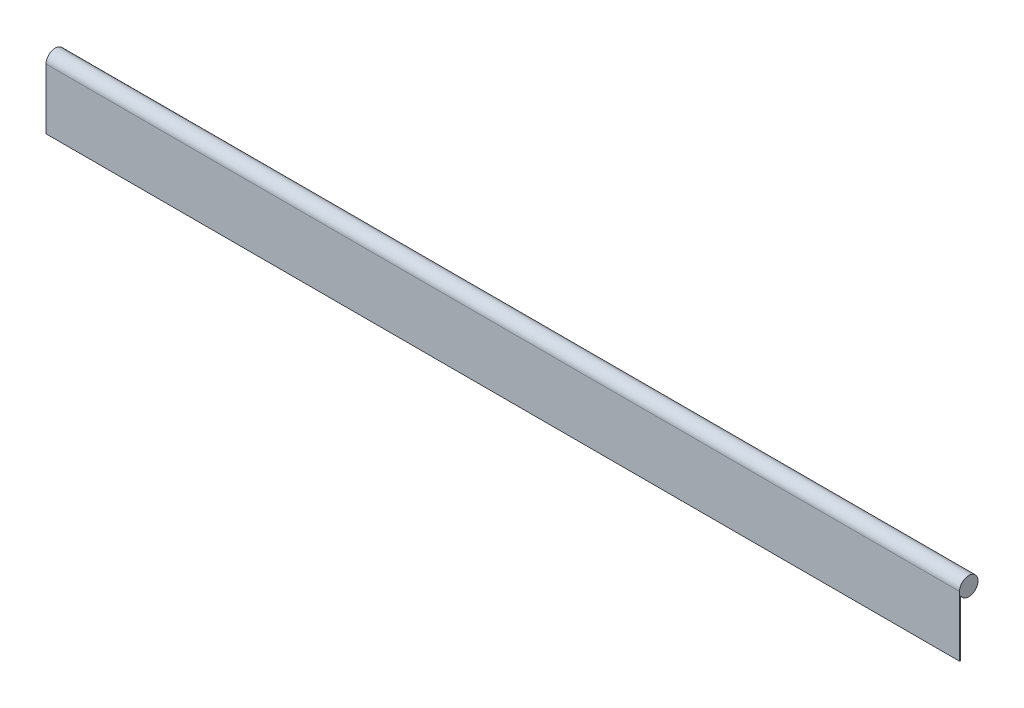
ISO-10303-21;
HEADER;
FILE_DESCRIPTION(('STEP AP214'),'2;1');
FILE_NAME('part.step','',(''),(''),'','','');
FILE_SCHEMA(('AUTOMOTIVE_DESIGN { 1 0 10303 214 1 1 1 1 }'));
ENDSEC;
DATA;
#1=APPLICATION_CONTEXT('core data for automotive mechanical design processes');
#2=APPLICATION_PROTOCOL_DEFINITION('international standard','automotive_design',2000,#1);
#3=PRODUCT_CONTEXT('',#1,'mechanical');
#4=PRODUCT('Part','Part','',(#3));
#5=PRODUCT_RELATED_PRODUCT_CATEGORY('part','',(#4));
#6=PRODUCT_DEFINITION_FORMATION('','',#4);
#7=PRODUCT_DEFINITION_CONTEXT('part definition',#1,'design');
#8=PRODUCT_DEFINITION('design','',#6,#7);
#9=PRODUCT_DEFINITION_SHAPE('','',#8);
#10=(LENGTH_UNIT() NAMED_UNIT(*) SI_UNIT(.MILLI.,.METRE.));
#11=(NAMED_UNIT(*) PLANE_ANGLE_UNIT() SI_UNIT($,.RADIAN.));
#12=(NAMED_UNIT(*) SI_UNIT($,.STERADIAN.) SOLID_ANGLE_UNIT());
#13=UNCERTAINTY_MEASURE_WITH_UNIT(LENGTH_MEASURE(1.E-05),#10,'distance_accuracy_value','');
#14=(GEOMETRIC_REPRESENTATION_CONTEXT(3) GLOBAL_UNCERTAINTY_ASSIGNED_CONTEXT((#13)) GLOBAL_UNIT_ASSIGNED_CONTEXT((#10,
#11,#12)) REPRESENTATION_CONTEXT('',''));
#15=CARTESIAN_POINT('',(0.,0.,0.));
#16=DIRECTION('',(0.,0.,1.));
#17=DIRECTION('',(1.,0.,0.));
#18=AXIS2_PLACEMENT_3D('',#15,#16,#17);
#19=CARTESIAN_POINT('',(1727.2,0.,0.));
#20=DIRECTION('',(-1.,0.,0.));
#21=DIRECTION('',(0.,0.,1.));
#22=AXIS2_PLACEMENT_3D('',#19,#20,#21);
#23=CYLINDRICAL_SURFACE('',#22,17.4625);
#24=CARTESIAN_POINT('',(0.,0.,0.));
#25=DIRECTION('',(1.,0.,0.));
#26=DIRECTION('',(0.,0.,-1.));
#27=AXIS2_PLACEMENT_3D('',#24,#25,#26);
#28=CIRCLE('',#27,17.4625);
#29=CARTESIAN_POINT('',(0.,-7.27483891574244,15.875));
#30=VERTEX_POINT('',#29);
#31=CARTESIAN_POINT('',(0.,0.,17.4625));
#32=VERTEX_POINT('',#31);
#33=EDGE_CURVE('E96',#30,#32,#28,.T.);
#34=ORIENTED_EDGE('',*,*,#33,.T.);
#35=DIRECTION('',(-1.,0.,0.));
#36=VECTOR('',#35,1.);
#37=CARTESIAN_POINT('',(1727.2,0.,17.4625));
#38=LINE('',#37,#36);
#39=CARTESIAN_POINT('',(1727.2,0.,17.4625));
#40=VERTEX_POINT('',#39);
#41=EDGE_CURVE('E11',#40,#32,#38,.T.);
#42=ORIENTED_EDGE('',*,*,#41,.F.);
#43=CARTESIAN_POINT('',(1727.2,0.,0.));
#44=DIRECTION('',(1.,0.,0.));
#45=DIRECTION('',(0.,0.,-1.));
#46=AXIS2_PLACEMENT_3D('',#43,#44,#45);
#47=CIRCLE('',#46,17.4625);
#48=CARTESIAN_POINT('',(1727.2,-7.27483891574244,15.875));
#49=VERTEX_POINT('',#48);
#50=EDGE_CURVE('E84',#49,#40,#47,.T.);
#51=ORIENTED_EDGE('',*,*,#50,.F.);
#52=DIRECTION('',(-1.,0.,0.));
#53=VECTOR('',#52,1.);
#54=CARTESIAN_POINT('',(1727.2,-7.27483891574244,15.875));
#55=LINE('',#54,#53);
#56=EDGE_CURVE('E92',#49,#30,#55,.T.);
#57=ORIENTED_EDGE('',*,*,#56,.T.);
#58=EDGE_LOOP('',(#34,#42,#51,#57));
#59=FACE_BOUND('',#58,.T.);
#60=ADVANCED_FACE('F33',(#59),#23,.T.);
#61=CARTESIAN_POINT('',(1727.2,0.,17.4625));
#62=DIRECTION('',(0.,0.,-1.));
#63=DIRECTION('',(0.,1.,0.));
#64=AXIS2_PLACEMENT_3D('',#61,#62,#63);
#65=PLANE('',#64);
#66=DIRECTION('',(0.,-1.,0.));
#67=VECTOR('',#66,1.);
#68=CARTESIAN_POINT('',(0.,0.,17.4625));
#69=LINE('',#68,#67);
#70=CARTESIAN_POINT('',(0.,-114.3,17.4625));
#71=VERTEX_POINT('',#70);
#72=EDGE_CURVE('E88',#32,#71,#69,.T.);
#73=ORIENTED_EDGE('',*,*,#72,.T.);
#74=DIRECTION('',(-1.,0.,0.));
#75=VECTOR('',#74,1.);
#76=CARTESIAN_POINT('',(1727.2,-114.3,17.4625));
#77=LINE('',#76,#75);
#78=CARTESIAN_POINT('',(1727.2,-114.3,17.4625));
#79=VERTEX_POINT('',#78);
#80=EDGE_CURVE('E41',#79,#71,#77,.T.);
#81=ORIENTED_EDGE('',*,*,#80,.F.);
#82=DIRECTION('',(0.,-1.,0.));
#83=VECTOR('',#82,1.);
#84=CARTESIAN_POINT('',(1727.2,0.,17.4625));
#85=LINE('',#84,#83);
#86=EDGE_CURVE('E79',#40,#79,#85,.T.);
#87=ORIENTED_EDGE('',*,*,#86,.F.);
#88=ORIENTED_EDGE('',*,*,#41,.T.);
#89=EDGE_LOOP('',(#73,#81,#87,#88));
#90=FACE_BOUND('',#89,.T.);
#91=ADVANCED_FACE('F87',(#90),#65,.F.);
#92=CARTESIAN_POINT('',(1727.2,-114.3,17.4625));
#93=DIRECTION('',(0.,1.,0.));
#94=DIRECTION('',(0.,0.,1.));
#95=AXIS2_PLACEMENT_3D('',#92,#93,#94);
#96=PLANE('',#95);
#97=DIRECTION('',(0.,0.,-1.));
#98=VECTOR('',#97,1.);
#99=CARTESIAN_POINT('',(0.,-114.3,17.4625));
#100=LINE('',#99,#98);
#101=CARTESIAN_POINT('',(0.,-114.3,15.875));
#102=VERTEX_POINT('',#101);
#103=EDGE_CURVE('E66',#71,#102,#100,.T.);
#104=ORIENTED_EDGE('',*,*,#103,.T.);
#105=DIRECTION('',(-1.,0.,0.));
#106=VECTOR('',#105,1.);
#107=CARTESIAN_POINT('',(1727.2,-114.3,15.875));
#108=LINE('',#107,#106);
#109=CARTESIAN_POINT('',(1727.2,-114.3,15.875));
#110=VERTEX_POINT('',#109);
#111=EDGE_CURVE('E89',#110,#102,#108,.T.);
#112=ORIENTED_EDGE('',*,*,#111,.F.);
#113=DIRECTION('',(0.,0.,-1.));
#114=VECTOR('',#113,1.);
#115=CARTESIAN_POINT('',(1727.2,-114.3,17.4625));
#116=LINE('',#115,#114);
#117=EDGE_CURVE('E82',#79,#110,#116,.T.);
#118=ORIENTED_EDGE('',*,*,#117,.F.);
#119=ORIENTED_EDGE('',*,*,#80,.T.);
#120=EDGE_LOOP('',(#104,#112,#118,#119));
#121=FACE_BOUND('',#120,.T.);
#122=ADVANCED_FACE('F90',(#121),#96,.F.);
#123=CARTESIAN_POINT('',(1727.2,-114.3,15.875));
#124=DIRECTION('',(0.,0.,1.));
#125=DIRECTION('',(0.,-1.,0.));
#126=AXIS2_PLACEMENT_3D('',#123,#124,#125);
#127=PLANE('',#126);
#128=DIRECTION('',(0.,1.,0.));
#129=VECTOR('',#128,1.);
#130=CARTESIAN_POINT('',(0.,-114.3,15.875));
#131=LINE('',#130,#129);
#132=EDGE_CURVE('E72',#102,#30,#131,.T.);
#133=ORIENTED_EDGE('',*,*,#132,.T.);
#134=ORIENTED_EDGE('',*,*,#56,.F.);
#135=DIRECTION('',(0.,1.,0.));
#136=VECTOR('',#135,1.);
#137=CARTESIAN_POINT('',(1727.2,-114.3,15.875));
#138=LINE('',#137,#136);
#139=EDGE_CURVE('E49',#110,#49,#138,.T.);
#140=ORIENTED_EDGE('',*,*,#139,.F.);
#141=ORIENTED_EDGE('',*,*,#111,.T.);
#142=EDGE_LOOP('',(#133,#134,#140,#141));
#143=FACE_BOUND('',#142,.T.);
#144=ADVANCED_FACE('F103',(#143),#127,.F.);
#145=CARTESIAN_POINT('',(1727.2,0.,0.));
#146=DIRECTION('',(1.,0.,0.));
#147=DIRECTION('',(0.,0.,-1.));
#148=AXIS2_PLACEMENT_3D('',#145,#146,#147);
#149=PLANE('',#148);
#150=ORIENTED_EDGE('',*,*,#50,.T.);
#151=ORIENTED_EDGE('',*,*,#86,.T.);
#152=ORIENTED_EDGE('',*,*,#117,.T.);
#153=ORIENTED_EDGE('',*,*,#139,.T.);
#154=EDGE_LOOP('',(#150,#151,#152,#153));
#155=FACE_BOUND('',#154,.T.);
#156=ADVANCED_FACE('F80',(#155),#149,.T.);
#157=CARTESIAN_POINT('',(0.,0.,0.));
#158=DIRECTION('',(1.,0.,0.));
#159=DIRECTION('',(0.,0.,-1.));
#160=AXIS2_PLACEMENT_3D('',#157,#158,#159);
#161=PLANE('',#160);
#162=ORIENTED_EDGE('',*,*,#33,.F.);
#163=ORIENTED_EDGE('',*,*,#132,.F.);
#164=ORIENTED_EDGE('',*,*,#103,.F.);
#165=ORIENTED_EDGE('',*,*,#72,.F.);
#166=EDGE_LOOP('',(#162,#163,#164,#165));
#167=FACE_BOUND('',#166,.T.);
#168=ADVANCED_FACE('F106',(#167),#161,.F.);
#169=CLOSED_SHELL('',(#60,#91,#122,#144,#156,#168));
#170=MANIFOLD_SOLID_BREP('B2',#169);
#171=ADVANCED_BREP_SHAPE_REPRESENTATION('',(#18,#170),#14);
#172=SHAPE_DEFINITION_REPRESENTATION(#9,#171);
ENDSEC;
END-ISO-10303-21;
